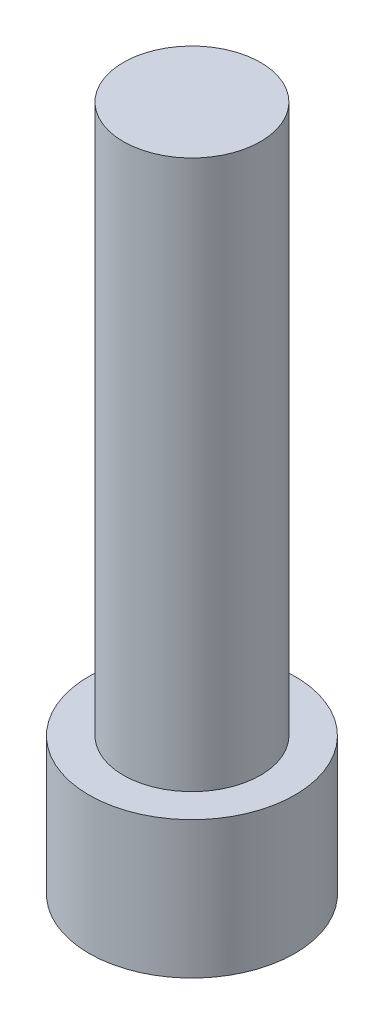
ISO-10303-21;
HEADER;
FILE_DESCRIPTION(('STEP AP214'),'2;1');
FILE_NAME('part.step','',(''),(''),'','','');
FILE_SCHEMA(('AUTOMOTIVE_DESIGN { 1 0 10303 214 1 1 1 1 }'));
ENDSEC;
DATA;
#1=APPLICATION_CONTEXT('core data for automotive mechanical design processes');
#2=APPLICATION_PROTOCOL_DEFINITION('international standard','automotive_design',2000,#1);
#3=PRODUCT_CONTEXT('',#1,'mechanical');
#4=PRODUCT('Part','Part','',(#3));
#5=PRODUCT_RELATED_PRODUCT_CATEGORY('part','',(#4));
#6=PRODUCT_DEFINITION_FORMATION('','',#4);
#7=PRODUCT_DEFINITION_CONTEXT('part definition',#1,'design');
#8=PRODUCT_DEFINITION('design','',#6,#7);
#9=PRODUCT_DEFINITION_SHAPE('','',#8);
#10=(LENGTH_UNIT() NAMED_UNIT(*) SI_UNIT(.MILLI.,.METRE.));
#11=(NAMED_UNIT(*) PLANE_ANGLE_UNIT() SI_UNIT($,.RADIAN.));
#12=(NAMED_UNIT(*) SI_UNIT($,.STERADIAN.) SOLID_ANGLE_UNIT());
#13=UNCERTAINTY_MEASURE_WITH_UNIT(LENGTH_MEASURE(1.E-05),#10,'distance_accuracy_value','');
#14=(GEOMETRIC_REPRESENTATION_CONTEXT(3) GLOBAL_UNCERTAINTY_ASSIGNED_CONTEXT((#13)) GLOBAL_UNIT_ASSIGNED_CONTEXT((#10,
#11,#12)) REPRESENTATION_CONTEXT('',''));
#15=CARTESIAN_POINT('',(0.,0.,0.));
#16=DIRECTION('',(0.,0.,1.));
#17=DIRECTION('',(1.,0.,0.));
#18=AXIS2_PLACEMENT_3D('',#15,#16,#17);
#19=CARTESIAN_POINT('',(0.,40.,0.));
#20=DIRECTION('',(0.,-1.,0.));
#21=DIRECTION('',(0.,0.,-1.));
#22=AXIS2_PLACEMENT_3D('',#19,#20,#21);
#23=CYLINDRICAL_SURFACE('',#22,5.);
#24=CARTESIAN_POINT('',(0.,40.,0.));
#25=DIRECTION('',(0.,1.,0.));
#26=DIRECTION('',(0.,0.,1.));
#27=AXIS2_PLACEMENT_3D('',#24,#25,#26);
#28=CIRCLE('',#27,5.);
#29=CARTESIAN_POINT('',(0.,40.,5.));
#30=VERTEX_POINT('',#29);
#31=EDGE_CURVE('E11',#30,#30,#28,.T.);
#32=ORIENTED_EDGE('',*,*,#31,.F.);
#33=EDGE_LOOP('',(#32));
#34=FACE_BOUND('',#33,.T.);
#35=CARTESIAN_POINT('',(0.,0.,0.));
#36=DIRECTION('',(0.,1.,0.));
#37=DIRECTION('',(0.,0.,1.));
#38=AXIS2_PLACEMENT_3D('',#35,#36,#37);
#39=CIRCLE('',#38,5.);
#40=CARTESIAN_POINT('',(0.,0.,5.));
#41=VERTEX_POINT('',#40);
#42=EDGE_CURVE('E48',#41,#41,#39,.T.);
#43=ORIENTED_EDGE('',*,*,#42,.T.);
#44=EDGE_LOOP('',(#43));
#45=FACE_BOUND('',#44,.T.);
#46=ADVANCED_FACE('F45',(#34,#45),#23,.T.);
#47=CARTESIAN_POINT('',(0.,40.,0.));
#48=DIRECTION('',(0.,1.,0.));
#49=DIRECTION('',(0.,0.,1.));
#50=AXIS2_PLACEMENT_3D('',#47,#48,#49);
#51=PLANE('',#50);
#52=ORIENTED_EDGE('',*,*,#31,.T.);
#53=EDGE_LOOP('',(#52));
#54=FACE_BOUND('',#53,.T.);
#55=ADVANCED_FACE('F191',(#54),#51,.T.);
#56=CARTESIAN_POINT('',(0.,-3.,0.));
#57=DIRECTION('',(0.,1.,0.));
#58=DIRECTION('',(0.,0.,1.));
#59=AXIS2_PLACEMENT_3D('',#56,#57,#58);
#60=CYLINDRICAL_SURFACE('',#59,7.5);
#61=CARTESIAN_POINT('',(0.,0.,0.));
#62=DIRECTION('',(0.,1.,0.));
#63=DIRECTION('',(0.,0.,1.));
#64=AXIS2_PLACEMENT_3D('',#61,#62,#63);
#65=CIRCLE('',#64,7.5);
#66=CARTESIAN_POINT('',(0.,0.,7.5));
#67=VERTEX_POINT('',#66);
#68=EDGE_CURVE('E171',#67,#67,#65,.T.);
#69=ORIENTED_EDGE('',*,*,#68,.F.);
#70=EDGE_LOOP('',(#69));
#71=FACE_BOUND('',#70,.T.);
#72=CARTESIAN_POINT('',(0.,-10.,0.));
#73=DIRECTION('',(0.,-1.,0.));
#74=DIRECTION('',(0.,0.,-1.));
#75=AXIS2_PLACEMENT_3D('',#72,#73,#74);
#76=CIRCLE('',#75,7.5);
#77=CARTESIAN_POINT('',(0.,-10.,-7.5));
#78=VERTEX_POINT('',#77);
#79=EDGE_CURVE('E115',#78,#78,#76,.T.);
#80=ORIENTED_EDGE('',*,*,#79,.F.);
#81=EDGE_LOOP('',(#80));
#82=FACE_BOUND('',#81,.T.);
#83=ADVANCED_FACE('F183',(#71,#82),#60,.T.);
#84=CARTESIAN_POINT('',(0.,0.,0.));
#85=DIRECTION('',(0.,1.,0.));
#86=DIRECTION('',(0.,0.,1.));
#87=AXIS2_PLACEMENT_3D('',#84,#85,#86);
#88=PLANE('',#87);
#89=ORIENTED_EDGE('',*,*,#42,.F.);
#90=EDGE_LOOP('',(#89));
#91=FACE_BOUND('',#90,.T.);
#92=ORIENTED_EDGE('',*,*,#68,.T.);
#93=EDGE_LOOP('',(#92));
#94=FACE_BOUND('',#93,.T.);
#95=ADVANCED_FACE('F181',(#91,#94),#88,.T.);
#96=CARTESIAN_POINT('',(0.,-10.,0.));
#97=DIRECTION('',(0.,-1.,0.));
#98=DIRECTION('',(0.,0.,-1.));
#99=AXIS2_PLACEMENT_3D('',#96,#97,#98);
#100=PLANE('',#99);
#101=ORIENTED_EDGE('',*,*,#79,.T.);
#102=EDGE_LOOP('',(#101));
#103=FACE_BOUND('',#102,.T.);
#104=DIRECTION('',(-0.5,0.,0.866025403784438));
#105=VECTOR('',#104,1.);
#106=CARTESIAN_POINT('',(5.77350269189626,-10.,0.));
#107=LINE('',#106,#105);
#108=CARTESIAN_POINT('',(5.77350269189626,-10.,0.));
#109=VERTEX_POINT('',#108);
#110=CARTESIAN_POINT('',(2.88675134594813,-10.,5.));
#111=VERTEX_POINT('',#110);
#112=EDGE_CURVE('E106',#109,#111,#107,.T.);
#113=ORIENTED_EDGE('',*,*,#112,.F.);
#114=DIRECTION('',(0.5,0.,0.866025403784439));
#115=VECTOR('',#114,1.);
#116=CARTESIAN_POINT('',(2.88675134594813,-10.,-5.));
#117=LINE('',#116,#115);
#118=CARTESIAN_POINT('',(2.88675134594813,-10.,-5.));
#119=VERTEX_POINT('',#118);
#120=EDGE_CURVE('E97',#119,#109,#117,.T.);
#121=ORIENTED_EDGE('',*,*,#120,.F.);
#122=DIRECTION('',(1.,0.,0.));
#123=VECTOR('',#122,1.);
#124=CARTESIAN_POINT('',(-2.88675134594813,-10.,-5.));
#125=LINE('',#124,#123);
#126=CARTESIAN_POINT('',(-2.88675134594813,-10.,-5.));
#127=VERTEX_POINT('',#126);
#128=EDGE_CURVE('E133',#127,#119,#125,.T.);
#129=ORIENTED_EDGE('',*,*,#128,.F.);
#130=DIRECTION('',(0.5,0.,-0.866025403784438));
#131=VECTOR('',#130,1.);
#132=CARTESIAN_POINT('',(-5.77350269189626,-10.,0.));
#133=LINE('',#132,#131);
#134=CARTESIAN_POINT('',(-5.77350269189626,-10.,0.));
#135=VERTEX_POINT('',#134);
#136=EDGE_CURVE('E130',#135,#127,#133,.T.);
#137=ORIENTED_EDGE('',*,*,#136,.F.);
#138=DIRECTION('',(-0.5,0.,-0.866025403784439));
#139=VECTOR('',#138,1.);
#140=CARTESIAN_POINT('',(-2.88675134594813,-10.,5.));
#141=LINE('',#140,#139);
#142=CARTESIAN_POINT('',(-2.88675134594813,-10.,5.));
#143=VERTEX_POINT('',#142);
#144=EDGE_CURVE('E125',#143,#135,#141,.T.);
#145=ORIENTED_EDGE('',*,*,#144,.F.);
#146=DIRECTION('',(-1.,0.,0.));
#147=VECTOR('',#146,1.);
#148=CARTESIAN_POINT('',(2.88675134594813,-10.,5.));
#149=LINE('',#148,#147);
#150=EDGE_CURVE('E121',#111,#143,#149,.T.);
#151=ORIENTED_EDGE('',*,*,#150,.F.);
#152=EDGE_LOOP('',(#113,#121,#129,#137,#145,#151));
#153=FACE_BOUND('',#152,.T.);
#154=ADVANCED_FACE('F119',(#103,#153),#100,.T.);
#155=CARTESIAN_POINT('',(2.88675134594813,-10.,-5.));
#156=DIRECTION('',(-0.866025403784439,0.,0.5));
#157=DIRECTION('',(0.5,0.,0.866025403784438));
#158=AXIS2_PLACEMENT_3D('',#155,#156,#157);
#159=PLANE('',#158);
#160=DIRECTION('',(0.5,0.,0.866025403784439));
#161=VECTOR('',#160,1.);
#162=CARTESIAN_POINT('',(2.88675134594813,-3.,-5.));
#163=LINE('',#162,#161);
#164=CARTESIAN_POINT('',(2.88675134594813,-3.,-5.));
#165=VERTEX_POINT('',#164);
#166=CARTESIAN_POINT('',(5.77350269189626,-3.,0.));
#167=VERTEX_POINT('',#166);
#168=EDGE_CURVE('E136',#165,#167,#163,.T.);
#169=ORIENTED_EDGE('',*,*,#168,.F.);
#170=DIRECTION('',(0.,1.,0.));
#171=VECTOR('',#170,1.);
#172=CARTESIAN_POINT('',(2.88675134594813,-10.,-5.));
#173=LINE('',#172,#171);
#174=EDGE_CURVE('E60',#119,#165,#173,.T.);
#175=ORIENTED_EDGE('',*,*,#174,.F.);
#176=ORIENTED_EDGE('',*,*,#120,.T.);
#177=DIRECTION('',(0.,1.,0.));
#178=VECTOR('',#177,1.);
#179=CARTESIAN_POINT('',(5.77350269189626,-10.,0.));
#180=LINE('',#179,#178);
#181=EDGE_CURVE('E100',#109,#167,#180,.T.);
#182=ORIENTED_EDGE('',*,*,#181,.T.);
#183=EDGE_LOOP('',(#169,#175,#176,#182));
#184=FACE_BOUND('',#183,.T.);
#185=ADVANCED_FACE('F99',(#184),#159,.T.);
#186=CARTESIAN_POINT('',(5.77350269189626,-10.,0.));
#187=DIRECTION('',(-0.866025403784438,0.,-0.5));
#188=DIRECTION('',(-0.5,0.,0.866025403784438));
#189=AXIS2_PLACEMENT_3D('',#186,#187,#188);
#190=PLANE('',#189);
#191=DIRECTION('',(-0.5,0.,0.866025403784438));
#192=VECTOR('',#191,1.);
#193=CARTESIAN_POINT('',(5.77350269189626,-3.,0.));
#194=LINE('',#193,#192);
#195=CARTESIAN_POINT('',(2.88675134594813,-3.,5.));
#196=VERTEX_POINT('',#195);
#197=EDGE_CURVE('E113',#167,#196,#194,.T.);
#198=ORIENTED_EDGE('',*,*,#197,.F.);
#199=ORIENTED_EDGE('',*,*,#181,.F.);
#200=ORIENTED_EDGE('',*,*,#112,.T.);
#201=DIRECTION('',(0.,1.,0.));
#202=VECTOR('',#201,1.);
#203=CARTESIAN_POINT('',(2.88675134594813,-10.,5.));
#204=LINE('',#203,#202);
#205=EDGE_CURVE('E116',#111,#196,#204,.T.);
#206=ORIENTED_EDGE('',*,*,#205,.T.);
#207=EDGE_LOOP('',(#198,#199,#200,#206));
#208=FACE_BOUND('',#207,.T.);
#209=ADVANCED_FACE('F110',(#208),#190,.T.);
#210=CARTESIAN_POINT('',(2.88675134594813,-10.,5.));
#211=DIRECTION('',(0.,0.,-1.));
#212=DIRECTION('',(-1.,0.,0.));
#213=AXIS2_PLACEMENT_3D('',#210,#211,#212);
#214=PLANE('',#213);
#215=DIRECTION('',(-1.,0.,0.));
#216=VECTOR('',#215,1.);
#217=CARTESIAN_POINT('',(2.88675134594813,-3.,5.));
#218=LINE('',#217,#216);
#219=CARTESIAN_POINT('',(-2.88675134594813,-3.,5.));
#220=VERTEX_POINT('',#219);
#221=EDGE_CURVE('E141',#196,#220,#218,.T.);
#222=ORIENTED_EDGE('',*,*,#221,.F.);
#223=ORIENTED_EDGE('',*,*,#205,.F.);
#224=ORIENTED_EDGE('',*,*,#150,.T.);
#225=DIRECTION('',(0.,1.,0.));
#226=VECTOR('',#225,1.);
#227=CARTESIAN_POINT('',(-2.88675134594813,-10.,5.));
#228=LINE('',#227,#226);
#229=EDGE_CURVE('E163',#143,#220,#228,.T.);
#230=ORIENTED_EDGE('',*,*,#229,.T.);
#231=EDGE_LOOP('',(#222,#223,#224,#230));
#232=FACE_BOUND('',#231,.T.);
#233=ADVANCED_FACE('F236',(#232),#214,.T.);
#234=CARTESIAN_POINT('',(-2.88675134594813,-10.,5.));
#235=DIRECTION('',(0.866025403784439,0.,-0.5));
#236=DIRECTION('',(-0.5,0.,-0.866025403784439));
#237=AXIS2_PLACEMENT_3D('',#234,#235,#236);
#238=PLANE('',#237);
#239=DIRECTION('',(-0.5,0.,-0.866025403784439));
#240=VECTOR('',#239,1.);
#241=CARTESIAN_POINT('',(-2.88675134594813,-3.,5.));
#242=LINE('',#241,#240);
#243=CARTESIAN_POINT('',(-5.77350269189626,-3.,0.));
#244=VERTEX_POINT('',#243);
#245=EDGE_CURVE('E145',#220,#244,#242,.T.);
#246=ORIENTED_EDGE('',*,*,#245,.F.);
#247=ORIENTED_EDGE('',*,*,#229,.F.);
#248=ORIENTED_EDGE('',*,*,#144,.T.);
#249=DIRECTION('',(0.,1.,0.));
#250=VECTOR('',#249,1.);
#251=CARTESIAN_POINT('',(-5.77350269189626,-10.,0.));
#252=LINE('',#251,#250);
#253=EDGE_CURVE('E160',#135,#244,#252,.T.);
#254=ORIENTED_EDGE('',*,*,#253,.T.);
#255=EDGE_LOOP('',(#246,#247,#248,#254));
#256=FACE_BOUND('',#255,.T.);
#257=ADVANCED_FACE('F246',(#256),#238,.T.);
#258=CARTESIAN_POINT('',(-5.77350269189626,-10.,0.));
#259=DIRECTION('',(0.866025403784438,0.,0.5));
#260=DIRECTION('',(0.5,0.,-0.866025403784438));
#261=AXIS2_PLACEMENT_3D('',#258,#259,#260);
#262=PLANE('',#261);
#263=DIRECTION('',(0.5,0.,-0.866025403784438));
#264=VECTOR('',#263,1.);
#265=CARTESIAN_POINT('',(-5.77350269189626,-3.,0.));
#266=LINE('',#265,#264);
#267=CARTESIAN_POINT('',(-2.88675134594813,-3.,-5.));
#268=VERTEX_POINT('',#267);
#269=EDGE_CURVE('E149',#244,#268,#266,.T.);
#270=ORIENTED_EDGE('',*,*,#269,.F.);
#271=ORIENTED_EDGE('',*,*,#253,.F.);
#272=ORIENTED_EDGE('',*,*,#136,.T.);
#273=DIRECTION('',(0.,1.,0.));
#274=VECTOR('',#273,1.);
#275=CARTESIAN_POINT('',(-2.88675134594813,-10.,-5.));
#276=LINE('',#275,#274);
#277=EDGE_CURVE('E65',#127,#268,#276,.T.);
#278=ORIENTED_EDGE('',*,*,#277,.T.);
#279=EDGE_LOOP('',(#270,#271,#272,#278));
#280=FACE_BOUND('',#279,.T.);
#281=ADVANCED_FACE('F257',(#280),#262,.T.);
#282=CARTESIAN_POINT('',(-2.88675134594813,-10.,-5.));
#283=DIRECTION('',(0.,0.,1.));
#284=DIRECTION('',(1.,0.,0.));
#285=AXIS2_PLACEMENT_3D('',#282,#283,#284);
#286=PLANE('',#285);
#287=DIRECTION('',(1.,0.,0.));
#288=VECTOR('',#287,1.);
#289=CARTESIAN_POINT('',(-2.88675134594813,-3.,-5.));
#290=LINE('',#289,#288);
#291=EDGE_CURVE('E107',#268,#165,#290,.T.);
#292=ORIENTED_EDGE('',*,*,#291,.F.);
#293=ORIENTED_EDGE('',*,*,#277,.F.);
#294=ORIENTED_EDGE('',*,*,#128,.T.);
#295=ORIENTED_EDGE('',*,*,#174,.T.);
#296=EDGE_LOOP('',(#292,#293,#294,#295));
#297=FACE_BOUND('',#296,.T.);
#298=ADVANCED_FACE('F268',(#297),#286,.T.);
#299=CARTESIAN_POINT('',(0.,-3.,0.));
#300=DIRECTION('',(0.,1.,0.));
#301=DIRECTION('',(0.,0.,1.));
#302=AXIS2_PLACEMENT_3D('',#299,#300,#301);
#303=PLANE('',#302);
#304=ORIENTED_EDGE('',*,*,#291,.T.);
#305=ORIENTED_EDGE('',*,*,#168,.T.);
#306=ORIENTED_EDGE('',*,*,#197,.T.);
#307=ORIENTED_EDGE('',*,*,#221,.T.);
#308=ORIENTED_EDGE('',*,*,#245,.T.);
#309=ORIENTED_EDGE('',*,*,#269,.T.);
#310=EDGE_LOOP('',(#304,#305,#306,#307,#308,#309));
#311=FACE_BOUND('',#310,.T.);
#312=ADVANCED_FACE('F279',(#311),#303,.F.);
#313=CLOSED_SHELL('',(#46,#55,#83,#95,#154,#185,#209,#233,#257,#281,#298,#312));
#314=MANIFOLD_SOLID_BREP('B2',#313);
#315=ADVANCED_BREP_SHAPE_REPRESENTATION('',(#18,#314),#14);
#316=SHAPE_DEFINITION_REPRESENTATION(#9,#315);
ENDSEC;
END-ISO-10303-21;
